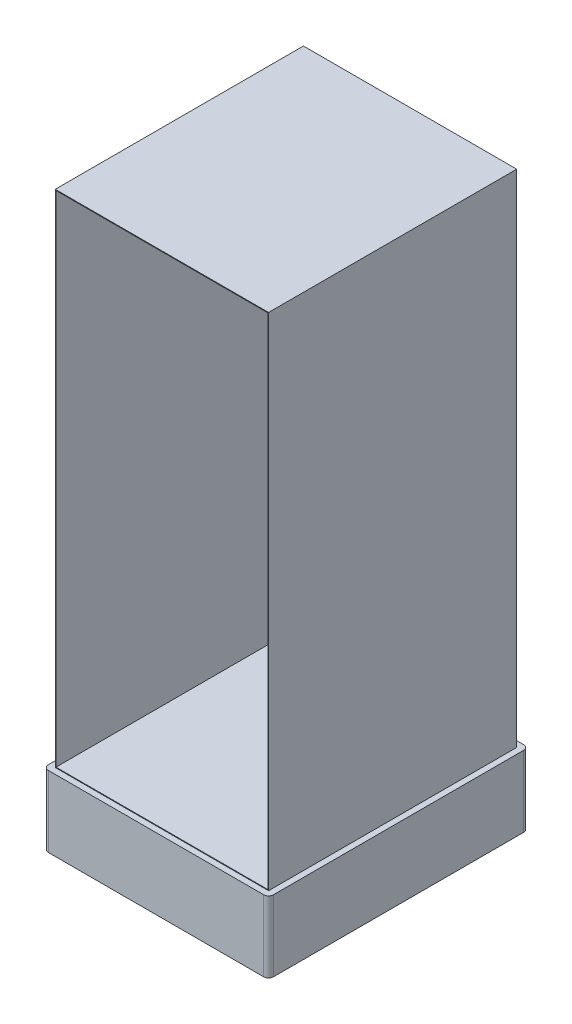
ISO-10303-21;
HEADER;
FILE_DESCRIPTION(('STEP AP214'),'2;1');
FILE_NAME('part.step','',(''),(''),'','','');
FILE_SCHEMA(('AUTOMOTIVE_DESIGN { 1 0 10303 214 1 1 1 1 }'));
ENDSEC;
DATA;
#1=APPLICATION_CONTEXT('core data for automotive mechanical design processes');
#2=APPLICATION_PROTOCOL_DEFINITION('international standard','automotive_design',2000,#1);
#3=PRODUCT_CONTEXT('',#1,'mechanical');
#4=PRODUCT('Part','Part','',(#3));
#5=PRODUCT_RELATED_PRODUCT_CATEGORY('part','',(#4));
#6=PRODUCT_DEFINITION_FORMATION('','',#4);
#7=PRODUCT_DEFINITION_CONTEXT('part definition',#1,'design');
#8=PRODUCT_DEFINITION('design','',#6,#7);
#9=PRODUCT_DEFINITION_SHAPE('','',#8);
#10=(LENGTH_UNIT() NAMED_UNIT(*) SI_UNIT(.MILLI.,.METRE.));
#11=(NAMED_UNIT(*) PLANE_ANGLE_UNIT() SI_UNIT($,.RADIAN.));
#12=(NAMED_UNIT(*) SI_UNIT($,.STERADIAN.) SOLID_ANGLE_UNIT());
#13=UNCERTAINTY_MEASURE_WITH_UNIT(LENGTH_MEASURE(1.E-05),#10,'distance_accuracy_value','');
#14=(GEOMETRIC_REPRESENTATION_CONTEXT(3) GLOBAL_UNCERTAINTY_ASSIGNED_CONTEXT((#13)) GLOBAL_UNIT_ASSIGNED_CONTEXT((#10,
#11,#12)) REPRESENTATION_CONTEXT('',''));
#15=CARTESIAN_POINT('',(0.,0.,0.));
#16=DIRECTION('',(0.,0.,1.));
#17=DIRECTION('',(1.,0.,0.));
#18=AXIS2_PLACEMENT_3D('',#15,#16,#17);
#19=CARTESIAN_POINT('',(-450.,2113.,523.5));
#20=DIRECTION('',(0.,0.,-1.));
#21=DIRECTION('',(-1.,0.,0.));
#22=AXIS2_PLACEMENT_3D('',#19,#20,#21);
#23=PLANE('',#22);
#24=DIRECTION('',(1.,0.,0.));
#25=VECTOR('',#24,1.);
#26=CARTESIAN_POINT('',(-450.,0.,523.5));
#27=LINE('',#26,#25);
#28=CARTESIAN_POINT('',(-450.,0.,523.5));
#29=VERTEX_POINT('',#28);
#30=CARTESIAN_POINT('',(450.,0.,523.5));
#31=VERTEX_POINT('',#30);
#32=EDGE_CURVE('E71',#29,#31,#27,.T.);
#33=ORIENTED_EDGE('',*,*,#32,.T.);
#34=DIRECTION('',(0.,-1.,0.));
#35=VECTOR('',#34,1.);
#36=CARTESIAN_POINT('',(450.,2113.,523.5));
#37=LINE('',#36,#35);
#38=CARTESIAN_POINT('',(450.,2113.,523.5));
#39=VERTEX_POINT('',#38);
#40=EDGE_CURVE('E108',#39,#31,#37,.T.);
#41=ORIENTED_EDGE('',*,*,#40,.F.);
#42=DIRECTION('',(1.,0.,0.));
#43=VECTOR('',#42,1.);
#44=CARTESIAN_POINT('',(-450.,2113.,523.5));
#45=LINE('',#44,#43);
#46=CARTESIAN_POINT('',(-450.,2113.,523.5));
#47=VERTEX_POINT('',#46);
#48=EDGE_CURVE('E58',#47,#39,#45,.T.);
#49=ORIENTED_EDGE('',*,*,#48,.F.);
#50=DIRECTION('',(0.,-1.,0.));
#51=VECTOR('',#50,1.);
#52=CARTESIAN_POINT('',(-450.,2113.,523.5));
#53=LINE('',#52,#51);
#54=EDGE_CURVE('E103',#47,#29,#53,.T.);
#55=ORIENTED_EDGE('',*,*,#54,.T.);
#56=EDGE_LOOP('',(#33,#41,#49,#55));
#57=FACE_BOUND('',#56,.T.);
#58=DIRECTION('',(-1.,0.,0.));
#59=VECTOR('',#58,1.);
#60=CARTESIAN_POINT('',(-450.,2110.,523.5));
#61=LINE('',#60,#59);
#62=CARTESIAN_POINT('',(447.,2110.,523.5));
#63=VERTEX_POINT('',#62);
#64=CARTESIAN_POINT('',(-447.,2110.,523.5));
#65=VERTEX_POINT('',#64);
#66=EDGE_CURVE('E11',#63,#65,#61,.T.);
#67=ORIENTED_EDGE('',*,*,#66,.F.);
#68=DIRECTION('',(0.,1.,0.));
#69=VECTOR('',#68,1.);
#70=CARTESIAN_POINT('',(447.,2113.,523.5));
#71=LINE('',#70,#69);
#72=CARTESIAN_POINT('',(447.,3.00000000000011,523.5));
#73=VERTEX_POINT('',#72);
#74=EDGE_CURVE('E122',#73,#63,#71,.T.);
#75=ORIENTED_EDGE('',*,*,#74,.F.);
#76=DIRECTION('',(1.,0.,0.));
#77=VECTOR('',#76,1.);
#78=CARTESIAN_POINT('',(-450.,3.00000000000011,523.5));
#79=LINE('',#78,#77);
#80=CARTESIAN_POINT('',(-447.,3.,523.5));
#81=VERTEX_POINT('',#80);
#82=EDGE_CURVE('E124',#81,#73,#79,.T.);
#83=ORIENTED_EDGE('',*,*,#82,.F.);
#84=DIRECTION('',(0.,-1.,0.));
#85=VECTOR('',#84,1.);
#86=CARTESIAN_POINT('',(-446.999999999983,2113.,523.5));
#87=LINE('',#86,#85);
#88=EDGE_CURVE('E42',#65,#81,#87,.T.);
#89=ORIENTED_EDGE('',*,*,#88,.F.);
#90=EDGE_LOOP('',(#67,#75,#83,#89));
#91=FACE_BOUND('',#90,.T.);
#92=ADVANCED_FACE('F34',(#57,#91),#23,.F.);
#93=CARTESIAN_POINT('',(450.,2113.,-523.5));
#94=DIRECTION('',(-1.,0.,0.));
#95=DIRECTION('',(0.,0.,1.));
#96=AXIS2_PLACEMENT_3D('',#93,#94,#95);
#97=PLANE('',#96);
#98=DIRECTION('',(0.,0.,-1.));
#99=VECTOR('',#98,1.);
#100=CARTESIAN_POINT('',(450.,0.,-523.5));
#101=LINE('',#100,#99);
#102=CARTESIAN_POINT('',(450.,0.,-523.5));
#103=VERTEX_POINT('',#102);
#104=EDGE_CURVE('E79',#31,#103,#101,.T.);
#105=ORIENTED_EDGE('',*,*,#104,.T.);
#106=DIRECTION('',(0.,-1.,0.));
#107=VECTOR('',#106,1.);
#108=CARTESIAN_POINT('',(450.,2113.,-523.5));
#109=LINE('',#108,#107);
#110=CARTESIAN_POINT('',(450.,2113.,-523.5));
#111=VERTEX_POINT('',#110);
#112=EDGE_CURVE('E102',#111,#103,#109,.T.);
#113=ORIENTED_EDGE('',*,*,#112,.F.);
#114=DIRECTION('',(0.,0.,-1.));
#115=VECTOR('',#114,1.);
#116=CARTESIAN_POINT('',(450.,2113.,-523.5));
#117=LINE('',#116,#115);
#118=EDGE_CURVE('E91',#39,#111,#117,.T.);
#119=ORIENTED_EDGE('',*,*,#118,.F.);
#120=ORIENTED_EDGE('',*,*,#40,.T.);
#121=EDGE_LOOP('',(#105,#113,#119,#120));
#122=FACE_BOUND('',#121,.T.);
#123=ADVANCED_FACE('F36',(#122),#97,.F.);
#124=CARTESIAN_POINT('',(-450.,2113.,-523.5));
#125=DIRECTION('',(0.,0.,1.));
#126=DIRECTION('',(1.,0.,0.));
#127=AXIS2_PLACEMENT_3D('',#124,#125,#126);
#128=PLANE('',#127);
#129=DIRECTION('',(-1.,0.,0.));
#130=VECTOR('',#129,1.);
#131=CARTESIAN_POINT('',(-450.,0.,-523.5));
#132=LINE('',#131,#130);
#133=CARTESIAN_POINT('',(-450.,0.,-523.5));
#134=VERTEX_POINT('',#133);
#135=EDGE_CURVE('E100',#103,#134,#132,.T.);
#136=ORIENTED_EDGE('',*,*,#135,.T.);
#137=DIRECTION('',(0.,-1.,0.));
#138=VECTOR('',#137,1.);
#139=CARTESIAN_POINT('',(-450.,2113.,-523.5));
#140=LINE('',#139,#138);
#141=CARTESIAN_POINT('',(-450.,2113.,-523.5));
#142=VERTEX_POINT('',#141);
#143=EDGE_CURVE('E98',#142,#134,#140,.T.);
#144=ORIENTED_EDGE('',*,*,#143,.F.);
#145=DIRECTION('',(-1.,0.,0.));
#146=VECTOR('',#145,1.);
#147=CARTESIAN_POINT('',(-450.,2113.,-523.5));
#148=LINE('',#147,#146);
#149=EDGE_CURVE('E84',#111,#142,#148,.T.);
#150=ORIENTED_EDGE('',*,*,#149,.F.);
#151=ORIENTED_EDGE('',*,*,#112,.T.);
#152=EDGE_LOOP('',(#136,#144,#150,#151));
#153=FACE_BOUND('',#152,.T.);
#154=ADVANCED_FACE('F99',(#153),#128,.F.);
#155=CARTESIAN_POINT('',(-450.,2113.,-523.5));
#156=DIRECTION('',(1.,0.,0.));
#157=DIRECTION('',(0.,0.,-1.));
#158=AXIS2_PLACEMENT_3D('',#155,#156,#157);
#159=PLANE('',#158);
#160=DIRECTION('',(0.,0.,1.));
#161=VECTOR('',#160,1.);
#162=CARTESIAN_POINT('',(-450.,0.,-523.5));
#163=LINE('',#162,#161);
#164=EDGE_CURVE('E115',#134,#29,#163,.T.);
#165=ORIENTED_EDGE('',*,*,#164,.T.);
#166=ORIENTED_EDGE('',*,*,#54,.F.);
#167=DIRECTION('',(0.,0.,1.));
#168=VECTOR('',#167,1.);
#169=CARTESIAN_POINT('',(-450.,2113.,-523.5));
#170=LINE('',#169,#168);
#171=EDGE_CURVE('E88',#142,#47,#170,.T.);
#172=ORIENTED_EDGE('',*,*,#171,.F.);
#173=ORIENTED_EDGE('',*,*,#143,.T.);
#174=EDGE_LOOP('',(#165,#166,#172,#173));
#175=FACE_BOUND('',#174,.T.);
#176=ADVANCED_FACE('F105',(#175),#159,.F.);
#177=CARTESIAN_POINT('',(0.,2113.,0.));
#178=DIRECTION('',(0.,1.,0.));
#179=DIRECTION('',(0.,0.,1.));
#180=AXIS2_PLACEMENT_3D('',#177,#178,#179);
#181=PLANE('',#180);
#182=ORIENTED_EDGE('',*,*,#118,.T.);
#183=ORIENTED_EDGE('',*,*,#149,.T.);
#184=ORIENTED_EDGE('',*,*,#171,.T.);
#185=ORIENTED_EDGE('',*,*,#48,.T.);
#186=EDGE_LOOP('',(#182,#183,#184,#185));
#187=FACE_BOUND('',#186,.T.);
#188=ADVANCED_FACE('F86',(#187),#181,.T.);
#189=CARTESIAN_POINT('',(454.356451520061,0.,527.856451520061));
#190=DIRECTION('',(0.,1.,0.));
#191=DIRECTION('',(0.,0.,1.));
#192=AXIS2_PLACEMENT_3D('',#189,#190,#191);
#193=PLANE('',#192);
#194=CARTESIAN_POINT('',(454.356451520061,0.,527.856451520061));
#195=DIRECTION('',(0.,-1.,0.));
#196=DIRECTION('',(0.,0.,1.));
#197=AXIS2_PLACEMENT_3D('',#194,#195,#196);
#198=CIRCLE('',#197,20.643548479939);
#199=CARTESIAN_POINT('',(475.,0.,527.856451520061));
#200=VERTEX_POINT('',#199);
#201=CARTESIAN_POINT('',(454.356451520061,0.,548.5));
#202=VERTEX_POINT('',#201);
#203=EDGE_CURVE('E171',#200,#202,#198,.T.);
#204=ORIENTED_EDGE('',*,*,#203,.F.);
#205=DIRECTION('',(0.,0.,1.));
#206=VECTOR('',#205,1.);
#207=CARTESIAN_POINT('',(475.,0.,527.856451520061));
#208=LINE('',#207,#206);
#209=CARTESIAN_POINT('',(475.,0.,-527.856451520061));
#210=VERTEX_POINT('',#209);
#211=EDGE_CURVE('E176',#210,#200,#208,.T.);
#212=ORIENTED_EDGE('',*,*,#211,.F.);
#213=CARTESIAN_POINT('',(454.356451520061,0.,-527.856451520061));
#214=DIRECTION('',(0.,-1.,0.));
#215=DIRECTION('',(0.,0.,-1.));
#216=AXIS2_PLACEMENT_3D('',#213,#214,#215);
#217=CIRCLE('',#216,20.643548479939);
#218=CARTESIAN_POINT('',(454.356451520061,0.,-548.5));
#219=VERTEX_POINT('',#218);
#220=EDGE_CURVE('E215',#219,#210,#217,.T.);
#221=ORIENTED_EDGE('',*,*,#220,.F.);
#222=DIRECTION('',(1.,0.,0.));
#223=VECTOR('',#222,1.);
#224=CARTESIAN_POINT('',(-454.356451520061,0.,-548.5));
#225=LINE('',#224,#223);
#226=CARTESIAN_POINT('',(-454.356451520061,0.,-548.5));
#227=VERTEX_POINT('',#226);
#228=EDGE_CURVE('E212',#227,#219,#225,.T.);
#229=ORIENTED_EDGE('',*,*,#228,.F.);
#230=CARTESIAN_POINT('',(-454.356451520061,0.,-527.856451520061));
#231=DIRECTION('',(0.,-1.,0.));
#232=DIRECTION('',(0.,0.,-1.));
#233=AXIS2_PLACEMENT_3D('',#230,#231,#232);
#234=CIRCLE('',#233,20.643548479939);
#235=CARTESIAN_POINT('',(-475.,0.,-527.856451520061));
#236=VERTEX_POINT('',#235);
#237=EDGE_CURVE('E209',#236,#227,#234,.T.);
#238=ORIENTED_EDGE('',*,*,#237,.F.);
#239=DIRECTION('',(0.,0.,-1.));
#240=VECTOR('',#239,1.);
#241=CARTESIAN_POINT('',(-475.,0.,527.856451520061));
#242=LINE('',#241,#240);
#243=CARTESIAN_POINT('',(-475.,0.,527.856451520061));
#244=VERTEX_POINT('',#243);
#245=EDGE_CURVE('E206',#244,#236,#242,.T.);
#246=ORIENTED_EDGE('',*,*,#245,.F.);
#247=CARTESIAN_POINT('',(-454.356451520061,0.,527.856451520061));
#248=DIRECTION('',(0.,-1.,0.));
#249=DIRECTION('',(0.,0.,-1.));
#250=AXIS2_PLACEMENT_3D('',#247,#248,#249);
#251=CIRCLE('',#250,20.643548479939);
#252=CARTESIAN_POINT('',(-454.356451520061,0.,548.5));
#253=VERTEX_POINT('',#252);
#254=EDGE_CURVE('E203',#253,#244,#251,.T.);
#255=ORIENTED_EDGE('',*,*,#254,.F.);
#256=DIRECTION('',(-1.,0.,0.));
#257=VECTOR('',#256,1.);
#258=CARTESIAN_POINT('',(-454.356451520061,0.,548.5));
#259=LINE('',#258,#257);
#260=EDGE_CURVE('E200',#202,#253,#259,.T.);
#261=ORIENTED_EDGE('',*,*,#260,.F.);
#262=EDGE_LOOP('',(#204,#212,#221,#229,#238,#246,#255,#261));
#263=FACE_BOUND('',#262,.T.);
#264=ORIENTED_EDGE('',*,*,#32,.F.);
#265=ORIENTED_EDGE('',*,*,#164,.F.);
#266=ORIENTED_EDGE('',*,*,#135,.F.);
#267=ORIENTED_EDGE('',*,*,#104,.F.);
#268=EDGE_LOOP('',(#264,#265,#266,#267));
#269=FACE_BOUND('',#268,.T.);
#270=ADVANCED_FACE('F259',(#263,#269),#193,.T.);
#271=CARTESIAN_POINT('',(454.356451520061,-300.,527.856451520061));
#272=DIRECTION('',(0.,1.,0.));
#273=DIRECTION('',(0.,0.,1.));
#274=AXIS2_PLACEMENT_3D('',#271,#272,#273);
#275=CYLINDRICAL_SURFACE('',#274,20.643548479939);
#276=ORIENTED_EDGE('',*,*,#203,.T.);
#277=DIRECTION('',(0.,1.,0.));
#278=VECTOR('',#277,1.);
#279=CARTESIAN_POINT('',(454.356451520061,-300.,548.5));
#280=LINE('',#279,#278);
#281=CARTESIAN_POINT('',(454.356451520061,-300.,548.5));
#282=VERTEX_POINT('',#281);
#283=EDGE_CURVE('E113',#282,#202,#280,.T.);
#284=ORIENTED_EDGE('',*,*,#283,.F.);
#285=CARTESIAN_POINT('',(454.356451520061,-300.,527.856451520061));
#286=DIRECTION('',(0.,-1.,0.));
#287=DIRECTION('',(0.,0.,1.));
#288=AXIS2_PLACEMENT_3D('',#285,#286,#287);
#289=CIRCLE('',#288,20.643548479939);
#290=CARTESIAN_POINT('',(475.,-300.,527.856451520061));
#291=VERTEX_POINT('',#290);
#292=EDGE_CURVE('E172',#291,#282,#289,.T.);
#293=ORIENTED_EDGE('',*,*,#292,.F.);
#294=DIRECTION('',(0.,1.,0.));
#295=VECTOR('',#294,1.);
#296=CARTESIAN_POINT('',(475.,-300.,527.856451520061));
#297=LINE('',#296,#295);
#298=EDGE_CURVE('E197',#291,#200,#297,.T.);
#299=ORIENTED_EDGE('',*,*,#298,.T.);
#300=EDGE_LOOP('',(#276,#284,#293,#299));
#301=FACE_BOUND('',#300,.T.);
#302=ADVANCED_FACE('F254',(#301),#275,.T.);
#303=CARTESIAN_POINT('',(-454.356451520061,-300.,548.5));
#304=DIRECTION('',(0.,0.,-1.));
#305=DIRECTION('',(-1.,0.,0.));
#306=AXIS2_PLACEMENT_3D('',#303,#304,#305);
#307=PLANE('',#306);
#308=ORIENTED_EDGE('',*,*,#260,.T.);
#309=DIRECTION('',(0.,1.,0.));
#310=VECTOR('',#309,1.);
#311=CARTESIAN_POINT('',(-454.356451520061,-300.,548.5));
#312=LINE('',#311,#310);
#313=CARTESIAN_POINT('',(-454.356451520061,-300.,548.5));
#314=VERTEX_POINT('',#313);
#315=EDGE_CURVE('E237',#314,#253,#312,.T.);
#316=ORIENTED_EDGE('',*,*,#315,.F.);
#317=DIRECTION('',(-1.,0.,0.));
#318=VECTOR('',#317,1.);
#319=CARTESIAN_POINT('',(-454.356451520061,-300.,548.5));
#320=LINE('',#319,#318);
#321=EDGE_CURVE('E175',#282,#314,#320,.T.);
#322=ORIENTED_EDGE('',*,*,#321,.F.);
#323=ORIENTED_EDGE('',*,*,#283,.T.);
#324=EDGE_LOOP('',(#308,#316,#322,#323));
#325=FACE_BOUND('',#324,.T.);
#326=ADVANCED_FACE('F245',(#325),#307,.F.);
#327=CARTESIAN_POINT('',(-454.356451520061,-300.,527.856451520061));
#328=DIRECTION('',(0.,1.,0.));
#329=DIRECTION('',(0.,0.,1.));
#330=AXIS2_PLACEMENT_3D('',#327,#328,#329);
#331=CYLINDRICAL_SURFACE('',#330,20.643548479939);
#332=ORIENTED_EDGE('',*,*,#254,.T.);
#333=DIRECTION('',(0.,1.,0.));
#334=VECTOR('',#333,1.);
#335=CARTESIAN_POINT('',(-475.,-300.,527.856451520061));
#336=LINE('',#335,#334);
#337=CARTESIAN_POINT('',(-475.,-300.,527.856451520061));
#338=VERTEX_POINT('',#337);
#339=EDGE_CURVE('E234',#338,#244,#336,.T.);
#340=ORIENTED_EDGE('',*,*,#339,.F.);
#341=CARTESIAN_POINT('',(-454.356451520061,-300.,527.856451520061));
#342=DIRECTION('',(0.,-1.,0.));
#343=DIRECTION('',(0.,0.,-1.));
#344=AXIS2_PLACEMENT_3D('',#341,#342,#343);
#345=CIRCLE('',#344,20.643548479939);
#346=EDGE_CURVE('E179',#314,#338,#345,.T.);
#347=ORIENTED_EDGE('',*,*,#346,.F.);
#348=ORIENTED_EDGE('',*,*,#315,.T.);
#349=EDGE_LOOP('',(#332,#340,#347,#348));
#350=FACE_BOUND('',#349,.T.);
#351=ADVANCED_FACE('F368',(#350),#331,.T.);
#352=CARTESIAN_POINT('',(-475.,-300.,527.856451520061));
#353=DIRECTION('',(1.,0.,0.));
#354=DIRECTION('',(0.,0.,-1.));
#355=AXIS2_PLACEMENT_3D('',#352,#353,#354);
#356=PLANE('',#355);
#357=ORIENTED_EDGE('',*,*,#245,.T.);
#358=DIRECTION('',(0.,1.,0.));
#359=VECTOR('',#358,1.);
#360=CARTESIAN_POINT('',(-475.,-300.,-527.856451520061));
#361=LINE('',#360,#359);
#362=CARTESIAN_POINT('',(-475.,-300.,-527.856451520061));
#363=VERTEX_POINT('',#362);
#364=EDGE_CURVE('E231',#363,#236,#361,.T.);
#365=ORIENTED_EDGE('',*,*,#364,.F.);
#366=DIRECTION('',(0.,0.,-1.));
#367=VECTOR('',#366,1.);
#368=CARTESIAN_POINT('',(-475.,-300.,527.856451520061));
#369=LINE('',#368,#367);
#370=EDGE_CURVE('E182',#338,#363,#369,.T.);
#371=ORIENTED_EDGE('',*,*,#370,.F.);
#372=ORIENTED_EDGE('',*,*,#339,.T.);
#373=EDGE_LOOP('',(#357,#365,#371,#372));
#374=FACE_BOUND('',#373,.T.);
#375=ADVANCED_FACE('F375',(#374),#356,.F.);
#376=CARTESIAN_POINT('',(-454.356451520061,-300.,-527.856451520061));
#377=DIRECTION('',(0.,1.,0.));
#378=DIRECTION('',(0.,0.,1.));
#379=AXIS2_PLACEMENT_3D('',#376,#377,#378);
#380=CYLINDRICAL_SURFACE('',#379,20.643548479939);
#381=ORIENTED_EDGE('',*,*,#237,.T.);
#382=DIRECTION('',(0.,1.,0.));
#383=VECTOR('',#382,1.);
#384=CARTESIAN_POINT('',(-454.356451520061,-300.,-548.5));
#385=LINE('',#384,#383);
#386=CARTESIAN_POINT('',(-454.356451520061,-300.,-548.5));
#387=VERTEX_POINT('',#386);
#388=EDGE_CURVE('E228',#387,#227,#385,.T.);
#389=ORIENTED_EDGE('',*,*,#388,.F.);
#390=CARTESIAN_POINT('',(-454.356451520061,-300.,-527.856451520061));
#391=DIRECTION('',(0.,-1.,0.));
#392=DIRECTION('',(0.,0.,-1.));
#393=AXIS2_PLACEMENT_3D('',#390,#391,#392);
#394=CIRCLE('',#393,20.643548479939);
#395=EDGE_CURVE('E185',#363,#387,#394,.T.);
#396=ORIENTED_EDGE('',*,*,#395,.F.);
#397=ORIENTED_EDGE('',*,*,#364,.T.);
#398=EDGE_LOOP('',(#381,#389,#396,#397));
#399=FACE_BOUND('',#398,.T.);
#400=ADVANCED_FACE('F382',(#399),#380,.T.);
#401=CARTESIAN_POINT('',(-454.356451520061,-300.,-548.5));
#402=DIRECTION('',(0.,0.,1.));
#403=DIRECTION('',(1.,0.,0.));
#404=AXIS2_PLACEMENT_3D('',#401,#402,#403);
#405=PLANE('',#404);
#406=ORIENTED_EDGE('',*,*,#228,.T.);
#407=DIRECTION('',(0.,1.,0.));
#408=VECTOR('',#407,1.);
#409=CARTESIAN_POINT('',(454.356451520061,-300.,-548.5));
#410=LINE('',#409,#408);
#411=CARTESIAN_POINT('',(454.356451520061,-300.,-548.5));
#412=VERTEX_POINT('',#411);
#413=EDGE_CURVE('E225',#412,#219,#410,.T.);
#414=ORIENTED_EDGE('',*,*,#413,.F.);
#415=DIRECTION('',(1.,0.,0.));
#416=VECTOR('',#415,1.);
#417=CARTESIAN_POINT('',(-454.356451520061,-300.,-548.5));
#418=LINE('',#417,#416);
#419=EDGE_CURVE('E188',#387,#412,#418,.T.);
#420=ORIENTED_EDGE('',*,*,#419,.F.);
#421=ORIENTED_EDGE('',*,*,#388,.T.);
#422=EDGE_LOOP('',(#406,#414,#420,#421));
#423=FACE_BOUND('',#422,.T.);
#424=ADVANCED_FACE('F288',(#423),#405,.F.);
#425=CARTESIAN_POINT('',(454.356451520061,-300.,-527.856451520061));
#426=DIRECTION('',(0.,1.,0.));
#427=DIRECTION('',(0.,0.,1.));
#428=AXIS2_PLACEMENT_3D('',#425,#426,#427);
#429=CYLINDRICAL_SURFACE('',#428,20.643548479939);
#430=ORIENTED_EDGE('',*,*,#220,.T.);
#431=DIRECTION('',(0.,1.,0.));
#432=VECTOR('',#431,1.);
#433=CARTESIAN_POINT('',(475.,-300.,-527.856451520061));
#434=LINE('',#433,#432);
#435=CARTESIAN_POINT('',(475.,-300.,-527.856451520061));
#436=VERTEX_POINT('',#435);
#437=EDGE_CURVE('E222',#436,#210,#434,.T.);
#438=ORIENTED_EDGE('',*,*,#437,.F.);
#439=CARTESIAN_POINT('',(454.356451520061,-300.,-527.856451520061));
#440=DIRECTION('',(0.,-1.,0.));
#441=DIRECTION('',(0.,0.,-1.));
#442=AXIS2_PLACEMENT_3D('',#439,#440,#441);
#443=CIRCLE('',#442,20.643548479939);
#444=EDGE_CURVE('E191',#412,#436,#443,.T.);
#445=ORIENTED_EDGE('',*,*,#444,.F.);
#446=ORIENTED_EDGE('',*,*,#413,.T.);
#447=EDGE_LOOP('',(#430,#438,#445,#446));
#448=FACE_BOUND('',#447,.T.);
#449=ADVANCED_FACE('F294',(#448),#429,.T.);
#450=CARTESIAN_POINT('',(475.,-300.,527.856451520061));
#451=DIRECTION('',(-1.,0.,0.));
#452=DIRECTION('',(0.,0.,1.));
#453=AXIS2_PLACEMENT_3D('',#450,#451,#452);
#454=PLANE('',#453);
#455=ORIENTED_EDGE('',*,*,#211,.T.);
#456=ORIENTED_EDGE('',*,*,#298,.F.);
#457=DIRECTION('',(0.,0.,1.));
#458=VECTOR('',#457,1.);
#459=CARTESIAN_POINT('',(475.,-300.,527.856451520061));
#460=LINE('',#459,#458);
#461=EDGE_CURVE('E194',#436,#291,#460,.T.);
#462=ORIENTED_EDGE('',*,*,#461,.F.);
#463=ORIENTED_EDGE('',*,*,#437,.T.);
#464=EDGE_LOOP('',(#455,#456,#462,#463));
#465=FACE_BOUND('',#464,.T.);
#466=ADVANCED_FACE('F402',(#465),#454,.F.);
#467=CARTESIAN_POINT('',(454.356451520061,-300.,527.856451520061));
#468=DIRECTION('',(0.,1.,0.));
#469=DIRECTION('',(0.,0.,1.));
#470=AXIS2_PLACEMENT_3D('',#467,#468,#469);
#471=PLANE('',#470);
#472=ORIENTED_EDGE('',*,*,#292,.T.);
#473=ORIENTED_EDGE('',*,*,#321,.T.);
#474=ORIENTED_EDGE('',*,*,#346,.T.);
#475=ORIENTED_EDGE('',*,*,#370,.T.);
#476=ORIENTED_EDGE('',*,*,#395,.T.);
#477=ORIENTED_EDGE('',*,*,#419,.T.);
#478=ORIENTED_EDGE('',*,*,#444,.T.);
#479=ORIENTED_EDGE('',*,*,#461,.T.);
#480=EDGE_LOOP('',(#472,#473,#474,#475,#476,#477,#478,#479));
#481=FACE_BOUND('',#480,.T.);
#482=ADVANCED_FACE('F297',(#481),#471,.F.);
#483=CARTESIAN_POINT('',(-447.,2110.,530.5));
#484=DIRECTION('',(0.,-1.,0.));
#485=DIRECTION('',(0.,0.,-1.));
#486=AXIS2_PLACEMENT_3D('',#483,#484,#485);
#487=PLANE('',#486);
#488=ORIENTED_EDGE('',*,*,#66,.T.);
#489=DIRECTION('',(0.,0.,-1.));
#490=VECTOR('',#489,1.);
#491=CARTESIAN_POINT('',(-447.,2110.,530.5));
#492=LINE('',#491,#490);
#493=CARTESIAN_POINT('',(-447.,2110.,-513.5));
#494=VERTEX_POINT('',#493);
#495=EDGE_CURVE('E139',#65,#494,#492,.T.);
#496=ORIENTED_EDGE('',*,*,#495,.T.);
#497=DIRECTION('',(-1.,0.,0.));
#498=VECTOR('',#497,1.);
#499=CARTESIAN_POINT('',(-447.,2110.,-513.5));
#500=LINE('',#499,#498);
#501=CARTESIAN_POINT('',(447.,2110.,-513.5));
#502=VERTEX_POINT('',#501);
#503=EDGE_CURVE('E163',#502,#494,#500,.T.);
#504=ORIENTED_EDGE('',*,*,#503,.F.);
#505=DIRECTION('',(0.,0.,-1.));
#506=VECTOR('',#505,1.);
#507=CARTESIAN_POINT('',(447.,2110.,530.5));
#508=LINE('',#507,#506);
#509=EDGE_CURVE('E156',#63,#502,#508,.T.);
#510=ORIENTED_EDGE('',*,*,#509,.F.);
#511=EDGE_LOOP('',(#488,#496,#504,#510));
#512=FACE_BOUND('',#511,.T.);
#513=ADVANCED_FACE('F161',(#512),#487,.T.);
#514=CARTESIAN_POINT('',(-447.,9.99999999999989,530.5));
#515=DIRECTION('',(1.,0.,0.));
#516=DIRECTION('',(0.,1.,0.));
#517=AXIS2_PLACEMENT_3D('',#514,#515,#516);
#518=PLANE('',#517);
#519=ORIENTED_EDGE('',*,*,#88,.T.);
#520=DIRECTION('',(0.,0.,-1.));
#521=VECTOR('',#520,1.);
#522=CARTESIAN_POINT('',(-447.,3.,530.5));
#523=LINE('',#522,#521);
#524=CARTESIAN_POINT('',(-447.,3.,-513.5));
#525=VERTEX_POINT('',#524);
#526=EDGE_CURVE('E135',#81,#525,#523,.T.);
#527=ORIENTED_EDGE('',*,*,#526,.T.);
#528=DIRECTION('',(0.,-1.,0.));
#529=VECTOR('',#528,1.);
#530=CARTESIAN_POINT('',(-447.,9.99999999999989,-513.5));
#531=LINE('',#530,#529);
#532=EDGE_CURVE('E312',#494,#525,#531,.T.);
#533=ORIENTED_EDGE('',*,*,#532,.F.);
#534=ORIENTED_EDGE('',*,*,#495,.F.);
#535=EDGE_LOOP('',(#519,#527,#533,#534));
#536=FACE_BOUND('',#535,.T.);
#537=ADVANCED_FACE('F132',(#536),#518,.T.);
#538=CARTESIAN_POINT('',(-447.,3.,530.5));
#539=DIRECTION('',(0.,1.,0.));
#540=DIRECTION('',(0.,0.,1.));
#541=AXIS2_PLACEMENT_3D('',#538,#539,#540);
#542=PLANE('',#541);
#543=ORIENTED_EDGE('',*,*,#82,.T.);
#544=DIRECTION('',(0.,0.,-1.));
#545=VECTOR('',#544,1.);
#546=CARTESIAN_POINT('',(447.,3.,530.5));
#547=LINE('',#546,#545);
#548=CARTESIAN_POINT('',(447.,3.,-513.5));
#549=VERTEX_POINT('',#548);
#550=EDGE_CURVE('E49',#73,#549,#547,.T.);
#551=ORIENTED_EDGE('',*,*,#550,.T.);
#552=DIRECTION('',(1.,0.,0.));
#553=VECTOR('',#552,1.);
#554=CARTESIAN_POINT('',(-447.,3.,-513.5));
#555=LINE('',#554,#553);
#556=EDGE_CURVE('E150',#525,#549,#555,.T.);
#557=ORIENTED_EDGE('',*,*,#556,.F.);
#558=ORIENTED_EDGE('',*,*,#526,.F.);
#559=EDGE_LOOP('',(#543,#551,#557,#558));
#560=FACE_BOUND('',#559,.T.);
#561=ADVANCED_FACE('F147',(#560),#542,.T.);
#562=CARTESIAN_POINT('',(447.,2110.,530.5));
#563=DIRECTION('',(-1.,0.,0.));
#564=DIRECTION('',(0.,-1.,0.));
#565=AXIS2_PLACEMENT_3D('',#562,#563,#564);
#566=PLANE('',#565);
#567=ORIENTED_EDGE('',*,*,#74,.T.);
#568=ORIENTED_EDGE('',*,*,#509,.T.);
#569=DIRECTION('',(0.,1.,0.));
#570=VECTOR('',#569,1.);
#571=CARTESIAN_POINT('',(447.,2110.,-513.5));
#572=LINE('',#571,#570);
#573=EDGE_CURVE('E164',#549,#502,#572,.T.);
#574=ORIENTED_EDGE('',*,*,#573,.F.);
#575=ORIENTED_EDGE('',*,*,#550,.F.);
#576=EDGE_LOOP('',(#567,#568,#574,#575));
#577=FACE_BOUND('',#576,.T.);
#578=ADVANCED_FACE('F154',(#577),#566,.T.);
#579=CARTESIAN_POINT('',(-450.,2113.,-513.5));
#580=DIRECTION('',(0.,0.,1.));
#581=DIRECTION('',(1.,0.,0.));
#582=AXIS2_PLACEMENT_3D('',#579,#580,#581);
#583=PLANE('',#582);
#584=ORIENTED_EDGE('',*,*,#503,.T.);
#585=ORIENTED_EDGE('',*,*,#532,.T.);
#586=ORIENTED_EDGE('',*,*,#556,.T.);
#587=ORIENTED_EDGE('',*,*,#573,.T.);
#588=EDGE_LOOP('',(#584,#585,#586,#587));
#589=FACE_BOUND('',#588,.T.);
#590=ADVANCED_FACE('F315',(#589),#583,.T.);
#591=CLOSED_SHELL('',(#92,#123,#154,#176,#188,#270,#302,#326,#351,#375,#400,#424,#449,#466,#482,
#513,#537,#561,#578,#590));
#592=MANIFOLD_SOLID_BREP('B2',#591);
#593=ADVANCED_BREP_SHAPE_REPRESENTATION('',(#18,#592),#14);
#594=SHAPE_DEFINITION_REPRESENTATION(#9,#593);
ENDSEC;
END-ISO-10303-21;
